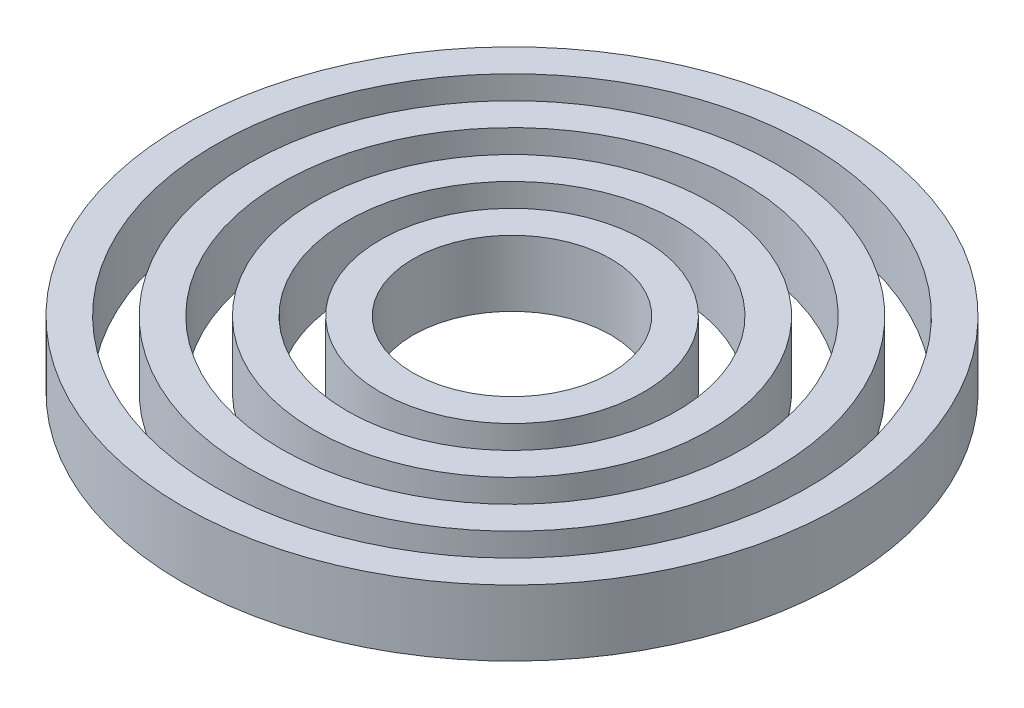
ISO-10303-21;
HEADER;
FILE_DESCRIPTION(('STEP AP214'),'2;1');
FILE_NAME('part.step','',(''),(''),'','','');
FILE_SCHEMA(('AUTOMOTIVE_DESIGN { 1 0 10303 214 1 1 1 1 }'));
ENDSEC;
DATA;
#1=APPLICATION_CONTEXT('core data for automotive mechanical design processes');
#2=APPLICATION_PROTOCOL_DEFINITION('international standard','automotive_design',2000,#1);
#3=PRODUCT_CONTEXT('',#1,'mechanical');
#4=PRODUCT('Part','Part','',(#3));
#5=PRODUCT_RELATED_PRODUCT_CATEGORY('part','',(#4));
#6=PRODUCT_DEFINITION_FORMATION('','',#4);
#7=PRODUCT_DEFINITION_CONTEXT('part definition',#1,'design');
#8=PRODUCT_DEFINITION('design','',#6,#7);
#9=PRODUCT_DEFINITION_SHAPE('','',#8);
#10=(LENGTH_UNIT() NAMED_UNIT(*) SI_UNIT(.MILLI.,.METRE.));
#11=(NAMED_UNIT(*) PLANE_ANGLE_UNIT() SI_UNIT($,.RADIAN.));
#12=(NAMED_UNIT(*) SI_UNIT($,.STERADIAN.) SOLID_ANGLE_UNIT());
#13=UNCERTAINTY_MEASURE_WITH_UNIT(LENGTH_MEASURE(1.E-05),#10,'distance_accuracy_value','');
#14=(GEOMETRIC_REPRESENTATION_CONTEXT(3) GLOBAL_UNCERTAINTY_ASSIGNED_CONTEXT((#13)) GLOBAL_UNIT_ASSIGNED_CONTEXT((#10,
#11,#12)) REPRESENTATION_CONTEXT('',''));
#15=CARTESIAN_POINT('',(0.,0.,0.));
#16=DIRECTION('',(0.,0.,1.));
#17=DIRECTION('',(1.,0.,0.));
#18=AXIS2_PLACEMENT_3D('',#15,#16,#17);
#19=CARTESIAN_POINT('',(11.3594961181899,10.,7.34789376861529));
#20=DIRECTION('',(0.,-1.,0.));
#21=DIRECTION('',(0.,0.,-1.));
#22=AXIS2_PLACEMENT_3D('',#19,#20,#21);
#23=CYLINDRICAL_SURFACE('',#22,15.);
#24=CARTESIAN_POINT('',(11.3594961181899,10.,7.34789376861529));
#25=DIRECTION('',(0.,1.,0.));
#26=DIRECTION('',(0.,0.,1.));
#27=AXIS2_PLACEMENT_3D('',#24,#25,#26);
#28=CIRCLE('',#27,15.);
#29=CARTESIAN_POINT('',(11.3594961181899,10.,22.3478937686153));
#30=VERTEX_POINT('',#29);
#31=EDGE_CURVE('E85',#30,#30,#28,.T.);
#32=ORIENTED_EDGE('',*,*,#31,.T.);
#33=EDGE_LOOP('',(#32));
#34=FACE_BOUND('',#33,.T.);
#35=CARTESIAN_POINT('',(11.3594961181899,0.,7.34789376861529));
#36=DIRECTION('',(0.,1.,0.));
#37=DIRECTION('',(0.,0.,1.));
#38=AXIS2_PLACEMENT_3D('',#35,#36,#37);
#39=CIRCLE('',#38,15.);
#40=CARTESIAN_POINT('',(11.3594961181899,0.,22.3478937686153));
#41=VERTEX_POINT('',#40);
#42=EDGE_CURVE('E91',#41,#41,#39,.T.);
#43=ORIENTED_EDGE('',*,*,#42,.F.);
#44=EDGE_LOOP('',(#43));
#45=FACE_BOUND('',#44,.T.);
#46=ADVANCED_FACE('F78',(#34,#45),#23,.F.);
#47=CARTESIAN_POINT('',(11.3594961181899,10.,7.34789376861529));
#48=DIRECTION('',(0.,-1.,0.));
#49=DIRECTION('',(0.,0.,-1.));
#50=AXIS2_PLACEMENT_3D('',#47,#48,#49);
#51=CYLINDRICAL_SURFACE('',#50,20.);
#52=CARTESIAN_POINT('',(11.3594961181899,10.,7.34789376861529));
#53=DIRECTION('',(0.,1.,0.));
#54=DIRECTION('',(0.,0.,1.));
#55=AXIS2_PLACEMENT_3D('',#52,#53,#54);
#56=CIRCLE('',#55,20.);
#57=CARTESIAN_POINT('',(11.3594961181899,10.,27.3478937686153));
#58=VERTEX_POINT('',#57);
#59=EDGE_CURVE('E12',#58,#58,#56,.T.);
#60=ORIENTED_EDGE('',*,*,#59,.F.);
#61=EDGE_LOOP('',(#60));
#62=FACE_BOUND('',#61,.T.);
#63=CARTESIAN_POINT('',(11.3594961181899,0.,7.34789376861529));
#64=DIRECTION('',(0.,1.,0.));
#65=DIRECTION('',(0.,0.,1.));
#66=AXIS2_PLACEMENT_3D('',#63,#64,#65);
#67=CIRCLE('',#66,20.);
#68=CARTESIAN_POINT('',(11.3594961181899,0.,27.3478937686153));
#69=VERTEX_POINT('',#68);
#70=EDGE_CURVE('E81',#69,#69,#67,.T.);
#71=ORIENTED_EDGE('',*,*,#70,.T.);
#72=EDGE_LOOP('',(#71));
#73=FACE_BOUND('',#72,.T.);
#74=ADVANCED_FACE('F98',(#62,#73),#51,.T.);
#75=CARTESIAN_POINT('',(0.,10.,0.));
#76=DIRECTION('',(0.,1.,0.));
#77=DIRECTION('',(0.,0.,1.));
#78=AXIS2_PLACEMENT_3D('',#75,#76,#77);
#79=PLANE('',#78);
#80=ORIENTED_EDGE('',*,*,#31,.F.);
#81=EDGE_LOOP('',(#80));
#82=FACE_BOUND('',#81,.T.);
#83=ORIENTED_EDGE('',*,*,#59,.T.);
#84=EDGE_LOOP('',(#83));
#85=FACE_BOUND('',#84,.T.);
#86=ADVANCED_FACE('F102',(#82,#85),#79,.T.);
#87=CARTESIAN_POINT('',(0.,0.,0.));
#88=DIRECTION('',(0.,1.,0.));
#89=DIRECTION('',(0.,0.,1.));
#90=AXIS2_PLACEMENT_3D('',#87,#88,#89);
#91=PLANE('',#90);
#92=ORIENTED_EDGE('',*,*,#42,.T.);
#93=EDGE_LOOP('',(#92));
#94=FACE_BOUND('',#93,.T.);
#95=ORIENTED_EDGE('',*,*,#70,.F.);
#96=EDGE_LOOP('',(#95));
#97=FACE_BOUND('',#96,.T.);
#98=ADVANCED_FACE('F100',(#94,#97),#91,.F.);
#99=CLOSED_SHELL('',(#46,#74,#86,#98));
#100=MANIFOLD_SOLID_BREP('B2',#99);
#101=CARTESIAN_POINT('',(11.3594961181899,10.,7.34789376861529));
#102=DIRECTION('',(0.,-1.,0.));
#103=DIRECTION('',(0.,0.,-1.));
#104=AXIS2_PLACEMENT_3D('',#101,#102,#103);
#105=CYLINDRICAL_SURFACE('',#104,25.);
#106=CARTESIAN_POINT('',(11.3594961181899,10.,7.34789376861529));
#107=DIRECTION('',(0.,1.,0.));
#108=DIRECTION('',(0.,0.,1.));
#109=AXIS2_PLACEMENT_3D('',#106,#107,#108);
#110=CIRCLE('',#109,25.);
#111=CARTESIAN_POINT('',(11.3594961181899,10.,32.3478937686153));
#112=VERTEX_POINT('',#111);
#113=EDGE_CURVE('E155',#112,#112,#110,.T.);
#114=ORIENTED_EDGE('',*,*,#113,.T.);
#115=EDGE_LOOP('',(#114));
#116=FACE_BOUND('',#115,.T.);
#117=CARTESIAN_POINT('',(11.3594961181899,0.,7.34789376861529));
#118=DIRECTION('',(0.,1.,0.));
#119=DIRECTION('',(0.,0.,1.));
#120=AXIS2_PLACEMENT_3D('',#117,#118,#119);
#121=CIRCLE('',#120,25.);
#122=CARTESIAN_POINT('',(11.3594961181899,0.,32.3478937686153));
#123=VERTEX_POINT('',#122);
#124=EDGE_CURVE('E161',#123,#123,#121,.T.);
#125=ORIENTED_EDGE('',*,*,#124,.F.);
#126=EDGE_LOOP('',(#125));
#127=FACE_BOUND('',#126,.T.);
#128=ADVANCED_FACE('F148',(#116,#127),#105,.F.);
#129=CARTESIAN_POINT('',(11.3594961181899,10.,7.34789376861529));
#130=DIRECTION('',(0.,-1.,0.));
#131=DIRECTION('',(0.,0.,-1.));
#132=AXIS2_PLACEMENT_3D('',#129,#130,#131);
#133=CYLINDRICAL_SURFACE('',#132,30.);
#134=CARTESIAN_POINT('',(11.3594961181899,10.,7.34789376861529));
#135=DIRECTION('',(0.,1.,0.));
#136=DIRECTION('',(0.,0.,1.));
#137=AXIS2_PLACEMENT_3D('',#134,#135,#136);
#138=CIRCLE('',#137,30.);
#139=CARTESIAN_POINT('',(11.3594961181899,10.,37.3478937686153));
#140=VERTEX_POINT('',#139);
#141=EDGE_CURVE('E77',#140,#140,#138,.T.);
#142=ORIENTED_EDGE('',*,*,#141,.F.);
#143=EDGE_LOOP('',(#142));
#144=FACE_BOUND('',#143,.T.);
#145=CARTESIAN_POINT('',(11.3594961181899,0.,7.34789376861529));
#146=DIRECTION('',(0.,1.,0.));
#147=DIRECTION('',(0.,0.,1.));
#148=AXIS2_PLACEMENT_3D('',#145,#146,#147);
#149=CIRCLE('',#148,30.);
#150=CARTESIAN_POINT('',(11.3594961181899,0.,37.3478937686153));
#151=VERTEX_POINT('',#150);
#152=EDGE_CURVE('E151',#151,#151,#149,.T.);
#153=ORIENTED_EDGE('',*,*,#152,.T.);
#154=EDGE_LOOP('',(#153));
#155=FACE_BOUND('',#154,.T.);
#156=ADVANCED_FACE('F168',(#144,#155),#133,.T.);
#157=CARTESIAN_POINT('',(0.,10.,0.));
#158=DIRECTION('',(0.,1.,0.));
#159=DIRECTION('',(0.,0.,1.));
#160=AXIS2_PLACEMENT_3D('',#157,#158,#159);
#161=PLANE('',#160);
#162=ORIENTED_EDGE('',*,*,#113,.F.);
#163=EDGE_LOOP('',(#162));
#164=FACE_BOUND('',#163,.T.);
#165=ORIENTED_EDGE('',*,*,#141,.T.);
#166=EDGE_LOOP('',(#165));
#167=FACE_BOUND('',#166,.T.);
#168=ADVANCED_FACE('F172',(#164,#167),#161,.T.);
#169=CARTESIAN_POINT('',(0.,0.,0.));
#170=DIRECTION('',(0.,1.,0.));
#171=DIRECTION('',(0.,0.,1.));
#172=AXIS2_PLACEMENT_3D('',#169,#170,#171);
#173=PLANE('',#172);
#174=ORIENTED_EDGE('',*,*,#124,.T.);
#175=EDGE_LOOP('',(#174));
#176=FACE_BOUND('',#175,.T.);
#177=ORIENTED_EDGE('',*,*,#152,.F.);
#178=EDGE_LOOP('',(#177));
#179=FACE_BOUND('',#178,.T.);
#180=ADVANCED_FACE('F170',(#176,#179),#173,.F.);
#181=CLOSED_SHELL('',(#128,#156,#168,#180));
#182=MANIFOLD_SOLID_BREP('B7',#181);
#183=CARTESIAN_POINT('',(11.3594961181899,10.,7.34789376861529));
#184=DIRECTION('',(0.,-1.,0.));
#185=DIRECTION('',(0.,0.,-1.));
#186=AXIS2_PLACEMENT_3D('',#183,#184,#185);
#187=CYLINDRICAL_SURFACE('',#186,35.);
#188=CARTESIAN_POINT('',(11.3594961181899,10.,7.34789376861529));
#189=DIRECTION('',(0.,1.,0.));
#190=DIRECTION('',(0.,0.,1.));
#191=AXIS2_PLACEMENT_3D('',#188,#189,#190);
#192=CIRCLE('',#191,35.);
#193=CARTESIAN_POINT('',(11.3594961181899,10.,42.3478937686153));
#194=VERTEX_POINT('',#193);
#195=EDGE_CURVE('E224',#194,#194,#192,.T.);
#196=ORIENTED_EDGE('',*,*,#195,.T.);
#197=EDGE_LOOP('',(#196));
#198=FACE_BOUND('',#197,.T.);
#199=CARTESIAN_POINT('',(11.3594961181899,0.,7.34789376861529));
#200=DIRECTION('',(0.,1.,0.));
#201=DIRECTION('',(0.,0.,1.));
#202=AXIS2_PLACEMENT_3D('',#199,#200,#201);
#203=CIRCLE('',#202,35.);
#204=CARTESIAN_POINT('',(11.3594961181899,0.,42.3478937686153));
#205=VERTEX_POINT('',#204);
#206=EDGE_CURVE('E230',#205,#205,#203,.T.);
#207=ORIENTED_EDGE('',*,*,#206,.F.);
#208=EDGE_LOOP('',(#207));
#209=FACE_BOUND('',#208,.T.);
#210=ADVANCED_FACE('F217',(#198,#209),#187,.F.);
#211=CARTESIAN_POINT('',(11.3594961181899,10.,7.34789376861529));
#212=DIRECTION('',(0.,-1.,0.));
#213=DIRECTION('',(0.,0.,-1.));
#214=AXIS2_PLACEMENT_3D('',#211,#212,#213);
#215=CYLINDRICAL_SURFACE('',#214,40.);
#216=CARTESIAN_POINT('',(11.3594961181899,10.,7.34789376861529));
#217=DIRECTION('',(0.,1.,0.));
#218=DIRECTION('',(0.,0.,1.));
#219=AXIS2_PLACEMENT_3D('',#216,#217,#218);
#220=CIRCLE('',#219,40.);
#221=CARTESIAN_POINT('',(11.3594961181899,10.,47.3478937686153));
#222=VERTEX_POINT('',#221);
#223=EDGE_CURVE('E147',#222,#222,#220,.T.);
#224=ORIENTED_EDGE('',*,*,#223,.F.);
#225=EDGE_LOOP('',(#224));
#226=FACE_BOUND('',#225,.T.);
#227=CARTESIAN_POINT('',(11.3594961181899,0.,7.34789376861529));
#228=DIRECTION('',(0.,1.,0.));
#229=DIRECTION('',(0.,0.,1.));
#230=AXIS2_PLACEMENT_3D('',#227,#228,#229);
#231=CIRCLE('',#230,40.);
#232=CARTESIAN_POINT('',(11.3594961181899,0.,47.3478937686153));
#233=VERTEX_POINT('',#232);
#234=EDGE_CURVE('E220',#233,#233,#231,.T.);
#235=ORIENTED_EDGE('',*,*,#234,.T.);
#236=EDGE_LOOP('',(#235));
#237=FACE_BOUND('',#236,.T.);
#238=ADVANCED_FACE('F237',(#226,#237),#215,.T.);
#239=CARTESIAN_POINT('',(0.,10.,0.));
#240=DIRECTION('',(0.,1.,0.));
#241=DIRECTION('',(0.,0.,1.));
#242=AXIS2_PLACEMENT_3D('',#239,#240,#241);
#243=PLANE('',#242);
#244=ORIENTED_EDGE('',*,*,#195,.F.);
#245=EDGE_LOOP('',(#244));
#246=FACE_BOUND('',#245,.T.);
#247=ORIENTED_EDGE('',*,*,#223,.T.);
#248=EDGE_LOOP('',(#247));
#249=FACE_BOUND('',#248,.T.);
#250=ADVANCED_FACE('F241',(#246,#249),#243,.T.);
#251=CARTESIAN_POINT('',(0.,0.,0.));
#252=DIRECTION('',(0.,1.,0.));
#253=DIRECTION('',(0.,0.,1.));
#254=AXIS2_PLACEMENT_3D('',#251,#252,#253);
#255=PLANE('',#254);
#256=ORIENTED_EDGE('',*,*,#206,.T.);
#257=EDGE_LOOP('',(#256));
#258=FACE_BOUND('',#257,.T.);
#259=ORIENTED_EDGE('',*,*,#234,.F.);
#260=EDGE_LOOP('',(#259));
#261=FACE_BOUND('',#260,.T.);
#262=ADVANCED_FACE('F239',(#258,#261),#255,.F.);
#263=CLOSED_SHELL('',(#210,#238,#250,#262));
#264=MANIFOLD_SOLID_BREP('B72',#263);
#265=CARTESIAN_POINT('',(11.3594961181899,10.,7.34789376861529));
#266=DIRECTION('',(0.,-1.,0.));
#267=DIRECTION('',(0.,0.,-1.));
#268=AXIS2_PLACEMENT_3D('',#265,#266,#267);
#269=CYLINDRICAL_SURFACE('',#268,45.);
#270=CARTESIAN_POINT('',(11.3594961181899,10.,7.34789376861529));
#271=DIRECTION('',(0.,1.,0.));
#272=DIRECTION('',(0.,0.,1.));
#273=AXIS2_PLACEMENT_3D('',#270,#271,#272);
#274=CIRCLE('',#273,45.);
#275=CARTESIAN_POINT('',(11.3594961181899,10.,52.3478937686153));
#276=VERTEX_POINT('',#275);
#277=EDGE_CURVE('E292',#276,#276,#274,.T.);
#278=ORIENTED_EDGE('',*,*,#277,.T.);
#279=EDGE_LOOP('',(#278));
#280=FACE_BOUND('',#279,.T.);
#281=CARTESIAN_POINT('',(11.3594961181899,0.,7.34789376861529));
#282=DIRECTION('',(0.,1.,0.));
#283=DIRECTION('',(0.,0.,1.));
#284=AXIS2_PLACEMENT_3D('',#281,#282,#283);
#285=CIRCLE('',#284,45.);
#286=CARTESIAN_POINT('',(11.3594961181899,0.,52.3478937686153));
#287=VERTEX_POINT('',#286);
#288=EDGE_CURVE('E298',#287,#287,#285,.T.);
#289=ORIENTED_EDGE('',*,*,#288,.F.);
#290=EDGE_LOOP('',(#289));
#291=FACE_BOUND('',#290,.T.);
#292=ADVANCED_FACE('F285',(#280,#291),#269,.F.);
#293=CARTESIAN_POINT('',(11.3594961181899,10.,7.34789376861529));
#294=DIRECTION('',(0.,-1.,0.));
#295=DIRECTION('',(0.,0.,-1.));
#296=AXIS2_PLACEMENT_3D('',#293,#294,#295);
#297=CYLINDRICAL_SURFACE('',#296,50.);
#298=CARTESIAN_POINT('',(11.3594961181899,10.,7.34789376861529));
#299=DIRECTION('',(0.,1.,0.));
#300=DIRECTION('',(0.,0.,1.));
#301=AXIS2_PLACEMENT_3D('',#298,#299,#300);
#302=CIRCLE('',#301,50.);
#303=CARTESIAN_POINT('',(11.3594961181899,10.,57.3478937686153));
#304=VERTEX_POINT('',#303);
#305=EDGE_CURVE('E216',#304,#304,#302,.T.);
#306=ORIENTED_EDGE('',*,*,#305,.F.);
#307=EDGE_LOOP('',(#306));
#308=FACE_BOUND('',#307,.T.);
#309=CARTESIAN_POINT('',(11.3594961181899,0.,7.34789376861529));
#310=DIRECTION('',(0.,1.,0.));
#311=DIRECTION('',(0.,0.,1.));
#312=AXIS2_PLACEMENT_3D('',#309,#310,#311);
#313=CIRCLE('',#312,50.);
#314=CARTESIAN_POINT('',(11.3594961181899,0.,57.3478937686153));
#315=VERTEX_POINT('',#314);
#316=EDGE_CURVE('E288',#315,#315,#313,.T.);
#317=ORIENTED_EDGE('',*,*,#316,.T.);
#318=EDGE_LOOP('',(#317));
#319=FACE_BOUND('',#318,.T.);
#320=ADVANCED_FACE('F305',(#308,#319),#297,.T.);
#321=CARTESIAN_POINT('',(0.,10.,0.));
#322=DIRECTION('',(0.,1.,0.));
#323=DIRECTION('',(0.,0.,1.));
#324=AXIS2_PLACEMENT_3D('',#321,#322,#323);
#325=PLANE('',#324);
#326=ORIENTED_EDGE('',*,*,#277,.F.);
#327=EDGE_LOOP('',(#326));
#328=FACE_BOUND('',#327,.T.);
#329=ORIENTED_EDGE('',*,*,#305,.T.);
#330=EDGE_LOOP('',(#329));
#331=FACE_BOUND('',#330,.T.);
#332=ADVANCED_FACE('F309',(#328,#331),#325,.T.);
#333=CARTESIAN_POINT('',(0.,0.,0.));
#334=DIRECTION('',(0.,1.,0.));
#335=DIRECTION('',(0.,0.,1.));
#336=AXIS2_PLACEMENT_3D('',#333,#334,#335);
#337=PLANE('',#336);
#338=ORIENTED_EDGE('',*,*,#288,.T.);
#339=EDGE_LOOP('',(#338));
#340=FACE_BOUND('',#339,.T.);
#341=ORIENTED_EDGE('',*,*,#316,.F.);
#342=EDGE_LOOP('',(#341));
#343=FACE_BOUND('',#342,.T.);
#344=ADVANCED_FACE('F307',(#340,#343),#337,.F.);
#345=CLOSED_SHELL('',(#292,#320,#332,#344));
#346=MANIFOLD_SOLID_BREP('B142',#345);
#347=ADVANCED_BREP_SHAPE_REPRESENTATION('',(#18,#100,#182,#264,#346),#14);
#348=SHAPE_DEFINITION_REPRESENTATION(#9,#347);
ENDSEC;
END-ISO-10303-21;
